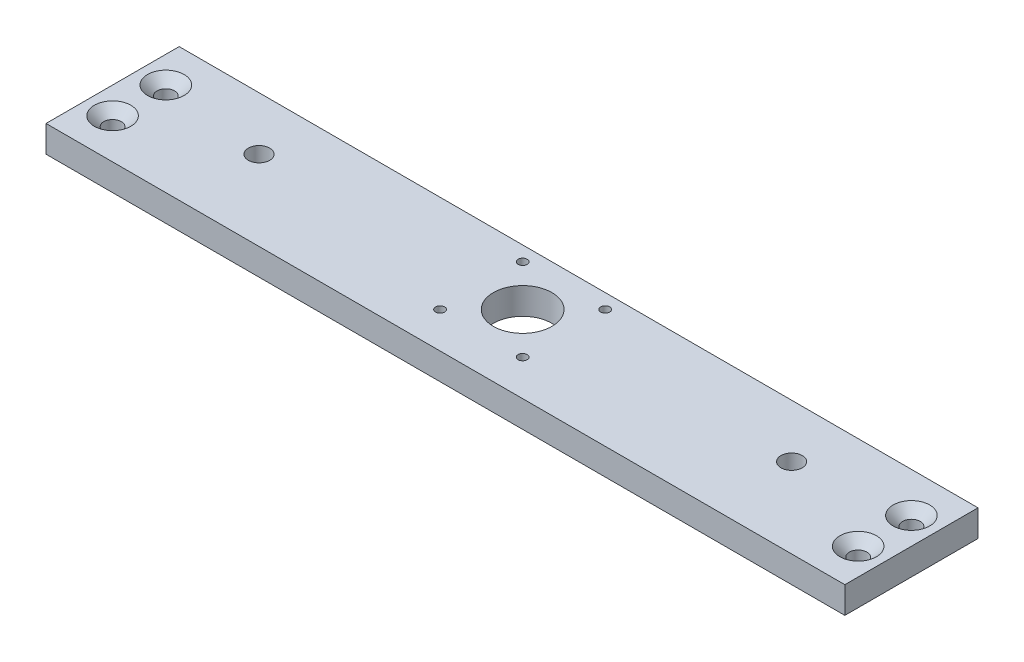
ISO-10303-21;
HEADER;
FILE_DESCRIPTION(('STEP AP214'),'2;1');
FILE_NAME('part.step','',(''),(''),'','','');
FILE_SCHEMA(('AUTOMOTIVE_DESIGN { 1 0 10303 214 1 1 1 1 }'));
ENDSEC;
DATA;
#1=APPLICATION_CONTEXT('core data for automotive mechanical design processes');
#2=APPLICATION_PROTOCOL_DEFINITION('international standard','automotive_design',2000,#1);
#3=PRODUCT_CONTEXT('',#1,'mechanical');
#4=PRODUCT('Part','Part','',(#3));
#5=PRODUCT_RELATED_PRODUCT_CATEGORY('part','',(#4));
#6=PRODUCT_DEFINITION_FORMATION('','',#4);
#7=PRODUCT_DEFINITION_CONTEXT('part definition',#1,'design');
#8=PRODUCT_DEFINITION('design','',#6,#7);
#9=PRODUCT_DEFINITION_SHAPE('','',#8);
#10=(LENGTH_UNIT() NAMED_UNIT(*) SI_UNIT(.MILLI.,.METRE.));
#11=(NAMED_UNIT(*) PLANE_ANGLE_UNIT() SI_UNIT($,.RADIAN.));
#12=(NAMED_UNIT(*) SI_UNIT($,.STERADIAN.) SOLID_ANGLE_UNIT());
#13=UNCERTAINTY_MEASURE_WITH_UNIT(LENGTH_MEASURE(1.E-05),#10,'distance_accuracy_value','');
#14=(GEOMETRIC_REPRESENTATION_CONTEXT(3) GLOBAL_UNCERTAINTY_ASSIGNED_CONTEXT((#13)) GLOBAL_UNIT_ASSIGNED_CONTEXT((#10,
#11,#12)) REPRESENTATION_CONTEXT('',''));
#15=CARTESIAN_POINT('',(0.,0.,0.));
#16=DIRECTION('',(0.,0.,1.));
#17=DIRECTION('',(1.,0.,0.));
#18=AXIS2_PLACEMENT_3D('',#15,#16,#17);
#19=CARTESIAN_POINT('',(0.,10.,0.));
#20=DIRECTION('',(0.,1.,0.));
#21=DIRECTION('',(0.,0.,1.));
#22=AXIS2_PLACEMENT_3D('',#19,#20,#21);
#23=PLANE('',#22);
#24=CARTESIAN_POINT('',(-15.5,10.,16.5));
#25=DIRECTION('',(0.,1.,0.));
#26=DIRECTION('',(0.,0.,1.));
#27=AXIS2_PLACEMENT_3D('',#24,#25,#26);
#28=CIRCLE('',#27,1.7);
#29=CARTESIAN_POINT('',(-15.5,10.,18.2));
#30=VERTEX_POINT('',#29);
#31=EDGE_CURVE('E40',#30,#30,#28,.T.);
#32=ORIENTED_EDGE('',*,*,#31,.F.);
#33=EDGE_LOOP('',(#32));
#34=FACE_BOUND('',#33,.T.);
#35=CARTESIAN_POINT('',(15.5,10.,16.5));
#36=DIRECTION('',(0.,1.,0.));
#37=DIRECTION('',(0.,0.,1.));
#38=AXIS2_PLACEMENT_3D('',#35,#36,#37);
#39=CIRCLE('',#38,1.7);
#40=CARTESIAN_POINT('',(15.5,10.,18.2));
#41=VERTEX_POINT('',#40);
#42=EDGE_CURVE('E141',#41,#41,#39,.T.);
#43=ORIENTED_EDGE('',*,*,#42,.F.);
#44=EDGE_LOOP('',(#43));
#45=FACE_BOUND('',#44,.T.);
#46=CARTESIAN_POINT('',(15.5,10.,-14.5));
#47=DIRECTION('',(0.,1.,0.));
#48=DIRECTION('',(0.,0.,1.));
#49=AXIS2_PLACEMENT_3D('',#46,#47,#48);
#50=CIRCLE('',#49,1.7);
#51=CARTESIAN_POINT('',(15.5,10.,-12.8));
#52=VERTEX_POINT('',#51);
#53=EDGE_CURVE('E137',#52,#52,#50,.T.);
#54=ORIENTED_EDGE('',*,*,#53,.F.);
#55=EDGE_LOOP('',(#54));
#56=FACE_BOUND('',#55,.T.);
#57=CARTESIAN_POINT('',(-15.5,10.,-14.5));
#58=DIRECTION('',(0.,1.,0.));
#59=DIRECTION('',(0.,0.,1.));
#60=AXIS2_PLACEMENT_3D('',#57,#58,#59);
#61=CIRCLE('',#60,1.7);
#62=CARTESIAN_POINT('',(-15.5,10.,-12.8));
#63=VERTEX_POINT('',#62);
#64=EDGE_CURVE('E132',#63,#63,#61,.T.);
#65=ORIENTED_EDGE('',*,*,#64,.F.);
#66=EDGE_LOOP('',(#65));
#67=FACE_BOUND('',#66,.T.);
#68=CARTESIAN_POINT('',(140.,10.,15.));
#69=DIRECTION('',(0.,1.,0.));
#70=DIRECTION('',(0.,0.,1.));
#71=AXIS2_PLACEMENT_3D('',#68,#69,#70);
#72=CIRCLE('',#71,6.855);
#73=CARTESIAN_POINT('',(140.,10.,21.855));
#74=VERTEX_POINT('',#73);
#75=EDGE_CURVE('E135',#74,#74,#72,.T.);
#76=ORIENTED_EDGE('',*,*,#75,.F.);
#77=EDGE_LOOP('',(#76));
#78=FACE_BOUND('',#77,.T.);
#79=CARTESIAN_POINT('',(140.,10.,-5.));
#80=DIRECTION('',(0.,1.,0.));
#81=DIRECTION('',(0.,0.,1.));
#82=AXIS2_PLACEMENT_3D('',#79,#80,#81);
#83=CIRCLE('',#82,6.855);
#84=CARTESIAN_POINT('',(140.,10.,1.855));
#85=VERTEX_POINT('',#84);
#86=EDGE_CURVE('E130',#85,#85,#83,.T.);
#87=ORIENTED_EDGE('',*,*,#86,.F.);
#88=EDGE_LOOP('',(#87));
#89=FACE_BOUND('',#88,.T.);
#90=CARTESIAN_POINT('',(-140.,10.,15.));
#91=DIRECTION('',(0.,1.,0.));
#92=DIRECTION('',(0.,0.,1.));
#93=AXIS2_PLACEMENT_3D('',#90,#91,#92);
#94=CIRCLE('',#93,6.855);
#95=CARTESIAN_POINT('',(-140.,10.,21.855));
#96=VERTEX_POINT('',#95);
#97=EDGE_CURVE('E125',#96,#96,#94,.T.);
#98=ORIENTED_EDGE('',*,*,#97,.F.);
#99=EDGE_LOOP('',(#98));
#100=FACE_BOUND('',#99,.T.);
#101=CARTESIAN_POINT('',(-140.,10.,-4.99999999999996));
#102=DIRECTION('',(0.,1.,0.));
#103=DIRECTION('',(0.,0.,1.));
#104=AXIS2_PLACEMENT_3D('',#101,#102,#103);
#105=CIRCLE('',#104,6.855);
#106=CARTESIAN_POINT('',(-140.,10.,1.85500000000004));
#107=VERTEX_POINT('',#106);
#108=EDGE_CURVE('E120',#107,#107,#105,.T.);
#109=ORIENTED_EDGE('',*,*,#108,.F.);
#110=EDGE_LOOP('',(#109));
#111=FACE_BOUND('',#110,.T.);
#112=CARTESIAN_POINT('',(0.,10.,1.));
#113=DIRECTION('',(0.,1.,0.));
#114=DIRECTION('',(0.,0.,1.));
#115=AXIS2_PLACEMENT_3D('',#112,#113,#114);
#116=CIRCLE('',#115,11.);
#117=CARTESIAN_POINT('',(0.,10.,12.));
#118=VERTEX_POINT('',#117);
#119=EDGE_CURVE('E115',#118,#118,#116,.T.);
#120=ORIENTED_EDGE('',*,*,#119,.F.);
#121=EDGE_LOOP('',(#120));
#122=FACE_BOUND('',#121,.T.);
#123=CARTESIAN_POINT('',(-100.,10.,0.));
#124=DIRECTION('',(0.,1.,0.));
#125=DIRECTION('',(0.,0.,1.));
#126=AXIS2_PLACEMENT_3D('',#123,#124,#125);
#127=CIRCLE('',#126,4.00000000000001);
#128=CARTESIAN_POINT('',(-100.,10.,4.00000000000002));
#129=VERTEX_POINT('',#128);
#130=EDGE_CURVE('E106',#129,#129,#127,.T.);
#131=ORIENTED_EDGE('',*,*,#130,.F.);
#132=EDGE_LOOP('',(#131));
#133=FACE_BOUND('',#132,.T.);
#134=DIRECTION('',(0.,0.,1.));
#135=VECTOR('',#134,1.);
#136=CARTESIAN_POINT('',(-150.,10.,30.));
#137=LINE('',#136,#135);
#138=CARTESIAN_POINT('',(-150.,10.,-20.));
#139=VERTEX_POINT('',#138);
#140=CARTESIAN_POINT('',(-150.,10.,30.));
#141=VERTEX_POINT('',#140);
#142=EDGE_CURVE('E90',#139,#141,#137,.T.);
#143=ORIENTED_EDGE('',*,*,#142,.T.);
#144=DIRECTION('',(1.,0.,0.));
#145=VECTOR('',#144,1.);
#146=CARTESIAN_POINT('',(150.,10.,30.));
#147=LINE('',#146,#145);
#148=CARTESIAN_POINT('',(150.,10.,30.));
#149=VERTEX_POINT('',#148);
#150=EDGE_CURVE('E85',#141,#149,#147,.T.);
#151=ORIENTED_EDGE('',*,*,#150,.T.);
#152=DIRECTION('',(0.,0.,-1.));
#153=VECTOR('',#152,1.);
#154=CARTESIAN_POINT('',(150.,10.,30.));
#155=LINE('',#154,#153);
#156=CARTESIAN_POINT('',(150.,10.,-20.));
#157=VERTEX_POINT('',#156);
#158=EDGE_CURVE('E88',#149,#157,#155,.T.);
#159=ORIENTED_EDGE('',*,*,#158,.T.);
#160=DIRECTION('',(-1.,0.,0.));
#161=VECTOR('',#160,1.);
#162=CARTESIAN_POINT('',(150.,10.,-20.));
#163=LINE('',#162,#161);
#164=EDGE_CURVE('E55',#157,#139,#163,.T.);
#165=ORIENTED_EDGE('',*,*,#164,.T.);
#166=EDGE_LOOP('',(#143,#151,#159,#165));
#167=FACE_BOUND('',#166,.T.);
#168=CARTESIAN_POINT('',(100.,10.,0.));
#169=DIRECTION('',(0.,1.,0.));
#170=DIRECTION('',(0.,0.,-1.));
#171=AXIS2_PLACEMENT_3D('',#168,#169,#170);
#172=CIRCLE('',#171,3.99999999999999);
#173=CARTESIAN_POINT('',(100.,10.,-4.));
#174=VERTEX_POINT('',#173);
#175=EDGE_CURVE('E186',#174,#174,#172,.T.);
#176=ORIENTED_EDGE('',*,*,#175,.F.);
#177=EDGE_LOOP('',(#176));
#178=FACE_BOUND('',#177,.T.);
#179=ADVANCED_FACE('F36',(#34,#45,#56,#67,#78,#89,#100,#111,#122,#133,#167,#178),#23,.T.);
#180=CARTESIAN_POINT('',(0.,0.,0.));
#181=DIRECTION('',(0.,1.,0.));
#182=DIRECTION('',(0.,0.,1.));
#183=AXIS2_PLACEMENT_3D('',#180,#181,#182);
#184=PLANE('',#183);
#185=CARTESIAN_POINT('',(-15.5,0.,16.5));
#186=DIRECTION('',(0.,-1.,0.));
#187=DIRECTION('',(0.,0.,-1.));
#188=AXIS2_PLACEMENT_3D('',#185,#186,#187);
#189=CIRCLE('',#188,3.47);
#190=CARTESIAN_POINT('',(-15.5,0.,13.03));
#191=VERTEX_POINT('',#190);
#192=EDGE_CURVE('E484',#191,#191,#189,.T.);
#193=ORIENTED_EDGE('',*,*,#192,.F.);
#194=EDGE_LOOP('',(#193));
#195=FACE_BOUND('',#194,.T.);
#196=CARTESIAN_POINT('',(15.5,0.,16.5));
#197=DIRECTION('',(0.,-1.,0.));
#198=DIRECTION('',(0.,0.,-1.));
#199=AXIS2_PLACEMENT_3D('',#196,#197,#198);
#200=CIRCLE('',#199,3.47);
#201=CARTESIAN_POINT('',(15.5,0.,13.03));
#202=VERTEX_POINT('',#201);
#203=EDGE_CURVE('E150',#202,#202,#200,.T.);
#204=ORIENTED_EDGE('',*,*,#203,.F.);
#205=EDGE_LOOP('',(#204));
#206=FACE_BOUND('',#205,.T.);
#207=CARTESIAN_POINT('',(15.5,0.,-14.5));
#208=DIRECTION('',(0.,-1.,0.));
#209=DIRECTION('',(0.,0.,-1.));
#210=AXIS2_PLACEMENT_3D('',#207,#208,#209);
#211=CIRCLE('',#210,3.47);
#212=CARTESIAN_POINT('',(15.5,0.,-17.97));
#213=VERTEX_POINT('',#212);
#214=EDGE_CURVE('E143',#213,#213,#211,.T.);
#215=ORIENTED_EDGE('',*,*,#214,.F.);
#216=EDGE_LOOP('',(#215));
#217=FACE_BOUND('',#216,.T.);
#218=CARTESIAN_POINT('',(-15.5,0.,-14.5));
#219=DIRECTION('',(0.,-1.,0.));
#220=DIRECTION('',(0.,0.,-1.));
#221=AXIS2_PLACEMENT_3D('',#218,#219,#220);
#222=CIRCLE('',#221,3.47);
#223=CARTESIAN_POINT('',(-15.5,0.,-17.97));
#224=VERTEX_POINT('',#223);
#225=EDGE_CURVE('E139',#224,#224,#222,.T.);
#226=ORIENTED_EDGE('',*,*,#225,.F.);
#227=EDGE_LOOP('',(#226));
#228=FACE_BOUND('',#227,.T.);
#229=CARTESIAN_POINT('',(140.,0.,15.));
#230=DIRECTION('',(0.,1.,0.));
#231=DIRECTION('',(0.,0.,1.));
#232=AXIS2_PLACEMENT_3D('',#229,#230,#231);
#233=CIRCLE('',#232,3.3);
#234=CARTESIAN_POINT('',(140.,0.,18.3));
#235=VERTEX_POINT('',#234);
#236=EDGE_CURVE('E127',#235,#235,#233,.T.);
#237=ORIENTED_EDGE('',*,*,#236,.T.);
#238=EDGE_LOOP('',(#237));
#239=FACE_BOUND('',#238,.T.);
#240=CARTESIAN_POINT('',(140.,0.,-5.));
#241=DIRECTION('',(0.,1.,0.));
#242=DIRECTION('',(0.,0.,1.));
#243=AXIS2_PLACEMENT_3D('',#240,#241,#242);
#244=CIRCLE('',#243,3.3);
#245=CARTESIAN_POINT('',(140.,0.,-1.7));
#246=VERTEX_POINT('',#245);
#247=EDGE_CURVE('E122',#246,#246,#244,.T.);
#248=ORIENTED_EDGE('',*,*,#247,.T.);
#249=EDGE_LOOP('',(#248));
#250=FACE_BOUND('',#249,.T.);
#251=CARTESIAN_POINT('',(-140.,0.,15.));
#252=DIRECTION('',(0.,1.,0.));
#253=DIRECTION('',(0.,0.,1.));
#254=AXIS2_PLACEMENT_3D('',#251,#252,#253);
#255=CIRCLE('',#254,3.3);
#256=CARTESIAN_POINT('',(-140.,0.,18.3));
#257=VERTEX_POINT('',#256);
#258=EDGE_CURVE('E117',#257,#257,#255,.T.);
#259=ORIENTED_EDGE('',*,*,#258,.T.);
#260=EDGE_LOOP('',(#259));
#261=FACE_BOUND('',#260,.T.);
#262=CARTESIAN_POINT('',(-140.,0.,-4.99999999999996));
#263=DIRECTION('',(0.,1.,0.));
#264=DIRECTION('',(0.,0.,1.));
#265=AXIS2_PLACEMENT_3D('',#262,#263,#264);
#266=CIRCLE('',#265,3.3);
#267=CARTESIAN_POINT('',(-140.,0.,-1.69999999999996));
#268=VERTEX_POINT('',#267);
#269=EDGE_CURVE('E112',#268,#268,#266,.T.);
#270=ORIENTED_EDGE('',*,*,#269,.T.);
#271=EDGE_LOOP('',(#270));
#272=FACE_BOUND('',#271,.T.);
#273=CARTESIAN_POINT('',(0.,0.,1.));
#274=DIRECTION('',(0.,1.,0.));
#275=DIRECTION('',(0.,0.,1.));
#276=AXIS2_PLACEMENT_3D('',#273,#274,#275);
#277=CIRCLE('',#276,11.);
#278=CARTESIAN_POINT('',(0.,0.,12.));
#279=VERTEX_POINT('',#278);
#280=EDGE_CURVE('E180',#279,#279,#277,.T.);
#281=ORIENTED_EDGE('',*,*,#280,.T.);
#282=EDGE_LOOP('',(#281));
#283=FACE_BOUND('',#282,.T.);
#284=DIRECTION('',(0.,0.,1.));
#285=VECTOR('',#284,1.);
#286=CARTESIAN_POINT('',(-150.,0.,30.));
#287=LINE('',#286,#285);
#288=CARTESIAN_POINT('',(-150.,0.,-20.));
#289=VERTEX_POINT('',#288);
#290=CARTESIAN_POINT('',(-150.,0.,30.));
#291=VERTEX_POINT('',#290);
#292=EDGE_CURVE('E103',#289,#291,#287,.T.);
#293=ORIENTED_EDGE('',*,*,#292,.F.);
#294=DIRECTION('',(-1.,0.,0.));
#295=VECTOR('',#294,1.);
#296=CARTESIAN_POINT('',(150.,0.,-20.));
#297=LINE('',#296,#295);
#298=CARTESIAN_POINT('',(150.,0.,-20.));
#299=VERTEX_POINT('',#298);
#300=EDGE_CURVE('E78',#299,#289,#297,.T.);
#301=ORIENTED_EDGE('',*,*,#300,.F.);
#302=DIRECTION('',(0.,0.,-1.));
#303=VECTOR('',#302,1.);
#304=CARTESIAN_POINT('',(150.,0.,30.));
#305=LINE('',#304,#303);
#306=CARTESIAN_POINT('',(150.,0.,30.));
#307=VERTEX_POINT('',#306);
#308=EDGE_CURVE('E72',#307,#299,#305,.T.);
#309=ORIENTED_EDGE('',*,*,#308,.F.);
#310=DIRECTION('',(1.,0.,0.));
#311=VECTOR('',#310,1.);
#312=CARTESIAN_POINT('',(150.,0.,30.));
#313=LINE('',#312,#311);
#314=EDGE_CURVE('E94',#291,#307,#313,.T.);
#315=ORIENTED_EDGE('',*,*,#314,.F.);
#316=EDGE_LOOP('',(#293,#301,#309,#315));
#317=FACE_BOUND('',#316,.T.);
#318=CARTESIAN_POINT('',(-100.,0.,0.));
#319=DIRECTION('',(0.,1.,0.));
#320=DIRECTION('',(0.,0.,1.));
#321=AXIS2_PLACEMENT_3D('',#318,#319,#320);
#322=CIRCLE('',#321,4.00000000000001);
#323=CARTESIAN_POINT('',(-100.,0.,4.00000000000002));
#324=VERTEX_POINT('',#323);
#325=EDGE_CURVE('E189',#324,#324,#322,.T.);
#326=ORIENTED_EDGE('',*,*,#325,.T.);
#327=EDGE_LOOP('',(#326));
#328=FACE_BOUND('',#327,.T.);
#329=CARTESIAN_POINT('',(100.,0.,0.));
#330=DIRECTION('',(0.,1.,0.));
#331=DIRECTION('',(0.,0.,-1.));
#332=AXIS2_PLACEMENT_3D('',#329,#330,#331);
#333=CIRCLE('',#332,3.99999999999999);
#334=CARTESIAN_POINT('',(100.,0.,-4.));
#335=VERTEX_POINT('',#334);
#336=EDGE_CURVE('E183',#335,#335,#333,.T.);
#337=ORIENTED_EDGE('',*,*,#336,.T.);
#338=EDGE_LOOP('',(#337));
#339=FACE_BOUND('',#338,.T.);
#340=ADVANCED_FACE('F197',(#195,#206,#217,#228,#239,#250,#261,#272,#283,#317,#328,#339),#184,.F.);
#341=CARTESIAN_POINT('',(-150.,10.,30.));
#342=DIRECTION('',(1.,0.,0.));
#343=DIRECTION('',(0.,0.,-1.));
#344=AXIS2_PLACEMENT_3D('',#341,#342,#343);
#345=PLANE('',#344);
#346=ORIENTED_EDGE('',*,*,#292,.T.);
#347=DIRECTION('',(0.,-1.,0.));
#348=VECTOR('',#347,1.);
#349=CARTESIAN_POINT('',(-150.,10.,30.));
#350=LINE('',#349,#348);
#351=EDGE_CURVE('E11',#141,#291,#350,.T.);
#352=ORIENTED_EDGE('',*,*,#351,.F.);
#353=ORIENTED_EDGE('',*,*,#142,.F.);
#354=DIRECTION('',(0.,-1.,0.));
#355=VECTOR('',#354,1.);
#356=CARTESIAN_POINT('',(-150.,10.,-20.));
#357=LINE('',#356,#355);
#358=EDGE_CURVE('E99',#139,#289,#357,.T.);
#359=ORIENTED_EDGE('',*,*,#358,.T.);
#360=EDGE_LOOP('',(#346,#352,#353,#359));
#361=FACE_BOUND('',#360,.T.);
#362=ADVANCED_FACE('F38',(#361),#345,.F.);
#363=CARTESIAN_POINT('',(150.,10.,30.));
#364=DIRECTION('',(0.,0.,-1.));
#365=DIRECTION('',(-1.,0.,0.));
#366=AXIS2_PLACEMENT_3D('',#363,#364,#365);
#367=PLANE('',#366);
#368=ORIENTED_EDGE('',*,*,#314,.T.);
#369=DIRECTION('',(0.,-1.,0.));
#370=VECTOR('',#369,1.);
#371=CARTESIAN_POINT('',(150.,10.,30.));
#372=LINE('',#371,#370);
#373=EDGE_CURVE('E46',#149,#307,#372,.T.);
#374=ORIENTED_EDGE('',*,*,#373,.F.);
#375=ORIENTED_EDGE('',*,*,#150,.F.);
#376=ORIENTED_EDGE('',*,*,#351,.T.);
#377=EDGE_LOOP('',(#368,#374,#375,#376));
#378=FACE_BOUND('',#377,.T.);
#379=ADVANCED_FACE('F93',(#378),#367,.F.);
#380=CARTESIAN_POINT('',(150.,10.,30.));
#381=DIRECTION('',(-1.,0.,0.));
#382=DIRECTION('',(0.,0.,1.));
#383=AXIS2_PLACEMENT_3D('',#380,#381,#382);
#384=PLANE('',#383);
#385=ORIENTED_EDGE('',*,*,#308,.T.);
#386=DIRECTION('',(0.,-1.,0.));
#387=VECTOR('',#386,1.);
#388=CARTESIAN_POINT('',(150.,10.,-20.));
#389=LINE('',#388,#387);
#390=EDGE_CURVE('E95',#157,#299,#389,.T.);
#391=ORIENTED_EDGE('',*,*,#390,.F.);
#392=ORIENTED_EDGE('',*,*,#158,.F.);
#393=ORIENTED_EDGE('',*,*,#373,.T.);
#394=EDGE_LOOP('',(#385,#391,#392,#393));
#395=FACE_BOUND('',#394,.T.);
#396=ADVANCED_FACE('F97',(#395),#384,.F.);
#397=CARTESIAN_POINT('',(150.,10.,-20.));
#398=DIRECTION('',(0.,0.,1.));
#399=DIRECTION('',(1.,0.,0.));
#400=AXIS2_PLACEMENT_3D('',#397,#398,#399);
#401=PLANE('',#400);
#402=ORIENTED_EDGE('',*,*,#300,.T.);
#403=ORIENTED_EDGE('',*,*,#358,.F.);
#404=ORIENTED_EDGE('',*,*,#164,.F.);
#405=ORIENTED_EDGE('',*,*,#390,.T.);
#406=EDGE_LOOP('',(#402,#403,#404,#405));
#407=FACE_BOUND('',#406,.T.);
#408=ADVANCED_FACE('F203',(#407),#401,.F.);
#409=CARTESIAN_POINT('',(-100.,10.,0.));
#410=DIRECTION('',(0.,-1.,0.));
#411=DIRECTION('',(0.,0.,-1.));
#412=AXIS2_PLACEMENT_3D('',#409,#410,#411);
#413=CYLINDRICAL_SURFACE('',#412,4.00000000000001);
#414=ORIENTED_EDGE('',*,*,#130,.T.);
#415=EDGE_LOOP('',(#414));
#416=FACE_BOUND('',#415,.T.);
#417=ORIENTED_EDGE('',*,*,#325,.F.);
#418=EDGE_LOOP('',(#417));
#419=FACE_BOUND('',#418,.T.);
#420=ADVANCED_FACE('F200',(#416,#419),#413,.F.);
#421=CARTESIAN_POINT('',(100.,10.,0.));
#422=DIRECTION('',(0.,-1.,0.));
#423=DIRECTION('',(0.,0.,-1.));
#424=AXIS2_PLACEMENT_3D('',#421,#422,#423);
#425=CYLINDRICAL_SURFACE('',#424,3.99999999999999);
#426=ORIENTED_EDGE('',*,*,#175,.T.);
#427=EDGE_LOOP('',(#426));
#428=FACE_BOUND('',#427,.T.);
#429=ORIENTED_EDGE('',*,*,#336,.F.);
#430=EDGE_LOOP('',(#429));
#431=FACE_BOUND('',#430,.T.);
#432=ADVANCED_FACE('F202',(#428,#431),#425,.F.);
#433=CARTESIAN_POINT('',(0.,0.,1.));
#434=DIRECTION('',(0.,1.,0.));
#435=DIRECTION('',(0.,0.,1.));
#436=AXIS2_PLACEMENT_3D('',#433,#434,#435);
#437=CYLINDRICAL_SURFACE('',#436,11.);
#438=ORIENTED_EDGE('',*,*,#280,.F.);
#439=EDGE_LOOP('',(#438));
#440=FACE_BOUND('',#439,.T.);
#441=ORIENTED_EDGE('',*,*,#119,.T.);
#442=EDGE_LOOP('',(#441));
#443=FACE_BOUND('',#442,.T.);
#444=ADVANCED_FACE('F210',(#440,#443),#437,.F.);
#445=CARTESIAN_POINT('',(-140.,10.,-4.99999999999996));
#446=DIRECTION('',(0.,1.,0.));
#447=DIRECTION('',(0.,0.,1.));
#448=AXIS2_PLACEMENT_3D('',#445,#446,#447);
#449=CYLINDRICAL_SURFACE('',#448,3.3);
#450=CARTESIAN_POINT('',(-140.,6.445,-4.99999999999996));
#451=DIRECTION('',(0.,1.,0.));
#452=DIRECTION('',(0.,0.,1.));
#453=AXIS2_PLACEMENT_3D('',#450,#451,#452);
#454=CIRCLE('',#453,3.3);
#455=CARTESIAN_POINT('',(-140.,6.445,-1.69999999999996));
#456=VERTEX_POINT('',#455);
#457=EDGE_CURVE('E116',#456,#456,#454,.T.);
#458=ORIENTED_EDGE('',*,*,#457,.T.);
#459=EDGE_LOOP('',(#458));
#460=FACE_BOUND('',#459,.T.);
#461=ORIENTED_EDGE('',*,*,#269,.F.);
#462=EDGE_LOOP('',(#461));
#463=FACE_BOUND('',#462,.T.);
#464=ADVANCED_FACE('F358',(#460,#463),#449,.F.);
#465=CARTESIAN_POINT('',(-140.,10.,-4.99999999999996));
#466=DIRECTION('',(0.,1.,0.));
#467=DIRECTION('',(0.,0.,1.));
#468=AXIS2_PLACEMENT_3D('',#465,#466,#467);
#469=CONICAL_SURFACE('',#468,6.855,0.785398163397448);
#470=ORIENTED_EDGE('',*,*,#457,.F.);
#471=EDGE_LOOP('',(#470));
#472=FACE_BOUND('',#471,.T.);
#473=ORIENTED_EDGE('',*,*,#108,.T.);
#474=EDGE_LOOP('',(#473));
#475=FACE_BOUND('',#474,.T.);
#476=ADVANCED_FACE('F354',(#472,#475),#469,.F.);
#477=CARTESIAN_POINT('',(-140.,10.,15.));
#478=DIRECTION('',(0.,1.,0.));
#479=DIRECTION('',(0.,0.,1.));
#480=AXIS2_PLACEMENT_3D('',#477,#478,#479);
#481=CYLINDRICAL_SURFACE('',#480,3.3);
#482=CARTESIAN_POINT('',(-140.,6.445,15.));
#483=DIRECTION('',(0.,1.,0.));
#484=DIRECTION('',(0.,0.,1.));
#485=AXIS2_PLACEMENT_3D('',#482,#483,#484);
#486=CIRCLE('',#485,3.3);
#487=CARTESIAN_POINT('',(-140.,6.445,18.3));
#488=VERTEX_POINT('',#487);
#489=EDGE_CURVE('E121',#488,#488,#486,.T.);
#490=ORIENTED_EDGE('',*,*,#489,.T.);
#491=EDGE_LOOP('',(#490));
#492=FACE_BOUND('',#491,.T.);
#493=ORIENTED_EDGE('',*,*,#258,.F.);
#494=EDGE_LOOP('',(#493));
#495=FACE_BOUND('',#494,.T.);
#496=ADVANCED_FACE('F350',(#492,#495),#481,.F.);
#497=CARTESIAN_POINT('',(-140.,10.,15.));
#498=DIRECTION('',(0.,1.,0.));
#499=DIRECTION('',(0.,0.,1.));
#500=AXIS2_PLACEMENT_3D('',#497,#498,#499);
#501=CONICAL_SURFACE('',#500,6.855,0.785398163397448);
#502=ORIENTED_EDGE('',*,*,#489,.F.);
#503=EDGE_LOOP('',(#502));
#504=FACE_BOUND('',#503,.T.);
#505=ORIENTED_EDGE('',*,*,#97,.T.);
#506=EDGE_LOOP('',(#505));
#507=FACE_BOUND('',#506,.T.);
#508=ADVANCED_FACE('F346',(#504,#507),#501,.F.);
#509=CARTESIAN_POINT('',(140.,10.,-5.));
#510=DIRECTION('',(0.,1.,0.));
#511=DIRECTION('',(0.,0.,1.));
#512=AXIS2_PLACEMENT_3D('',#509,#510,#511);
#513=CYLINDRICAL_SURFACE('',#512,3.3);
#514=CARTESIAN_POINT('',(140.,6.445,-5.));
#515=DIRECTION('',(0.,1.,0.));
#516=DIRECTION('',(0.,0.,1.));
#517=AXIS2_PLACEMENT_3D('',#514,#515,#516);
#518=CIRCLE('',#517,3.3);
#519=CARTESIAN_POINT('',(140.,6.445,-1.7));
#520=VERTEX_POINT('',#519);
#521=EDGE_CURVE('E126',#520,#520,#518,.T.);
#522=ORIENTED_EDGE('',*,*,#521,.T.);
#523=EDGE_LOOP('',(#522));
#524=FACE_BOUND('',#523,.T.);
#525=ORIENTED_EDGE('',*,*,#247,.F.);
#526=EDGE_LOOP('',(#525));
#527=FACE_BOUND('',#526,.T.);
#528=ADVANCED_FACE('F342',(#524,#527),#513,.F.);
#529=CARTESIAN_POINT('',(140.,10.,-5.));
#530=DIRECTION('',(0.,1.,0.));
#531=DIRECTION('',(0.,0.,1.));
#532=AXIS2_PLACEMENT_3D('',#529,#530,#531);
#533=CONICAL_SURFACE('',#532,6.855,0.785398163397448);
#534=ORIENTED_EDGE('',*,*,#521,.F.);
#535=EDGE_LOOP('',(#534));
#536=FACE_BOUND('',#535,.T.);
#537=ORIENTED_EDGE('',*,*,#86,.T.);
#538=EDGE_LOOP('',(#537));
#539=FACE_BOUND('',#538,.T.);
#540=ADVANCED_FACE('F338',(#536,#539),#533,.F.);
#541=CARTESIAN_POINT('',(140.,10.,15.));
#542=DIRECTION('',(0.,1.,0.));
#543=DIRECTION('',(0.,0.,1.));
#544=AXIS2_PLACEMENT_3D('',#541,#542,#543);
#545=CYLINDRICAL_SURFACE('',#544,3.3);
#546=CARTESIAN_POINT('',(140.,6.445,15.));
#547=DIRECTION('',(0.,1.,0.));
#548=DIRECTION('',(0.,0.,1.));
#549=AXIS2_PLACEMENT_3D('',#546,#547,#548);
#550=CIRCLE('',#549,3.3);
#551=CARTESIAN_POINT('',(140.,6.445,18.3));
#552=VERTEX_POINT('',#551);
#553=EDGE_CURVE('E131',#552,#552,#550,.T.);
#554=ORIENTED_EDGE('',*,*,#553,.T.);
#555=EDGE_LOOP('',(#554));
#556=FACE_BOUND('',#555,.T.);
#557=ORIENTED_EDGE('',*,*,#236,.F.);
#558=EDGE_LOOP('',(#557));
#559=FACE_BOUND('',#558,.T.);
#560=ADVANCED_FACE('F334',(#556,#559),#545,.F.);
#561=CARTESIAN_POINT('',(140.,10.,15.));
#562=DIRECTION('',(0.,1.,0.));
#563=DIRECTION('',(0.,0.,1.));
#564=AXIS2_PLACEMENT_3D('',#561,#562,#563);
#565=CONICAL_SURFACE('',#564,6.855,0.785398163397448);
#566=ORIENTED_EDGE('',*,*,#553,.F.);
#567=EDGE_LOOP('',(#566));
#568=FACE_BOUND('',#567,.T.);
#569=ORIENTED_EDGE('',*,*,#75,.T.);
#570=EDGE_LOOP('',(#569));
#571=FACE_BOUND('',#570,.T.);
#572=ADVANCED_FACE('F255',(#568,#571),#565,.F.);
#573=CARTESIAN_POINT('',(-15.5,0.,-14.5));
#574=DIRECTION('',(0.,-1.,0.));
#575=DIRECTION('',(0.,0.,-1.));
#576=AXIS2_PLACEMENT_3D('',#573,#574,#575);
#577=CYLINDRICAL_SURFACE('',#576,1.7);
#578=ORIENTED_EDGE('',*,*,#64,.T.);
#579=EDGE_LOOP('',(#578));
#580=FACE_BOUND('',#579,.T.);
#581=CARTESIAN_POINT('',(-15.5,1.77,-14.5));
#582=DIRECTION('',(0.,-1.,0.));
#583=DIRECTION('',(0.,0.,-1.));
#584=AXIS2_PLACEMENT_3D('',#581,#582,#583);
#585=CIRCLE('',#584,1.7);
#586=CARTESIAN_POINT('',(-15.5,1.77,-16.2));
#587=VERTEX_POINT('',#586);
#588=EDGE_CURVE('E136',#587,#587,#585,.T.);
#589=ORIENTED_EDGE('',*,*,#588,.T.);
#590=EDGE_LOOP('',(#589));
#591=FACE_BOUND('',#590,.T.);
#592=ADVANCED_FACE('F249',(#580,#591),#577,.F.);
#593=CARTESIAN_POINT('',(-15.5,0.,-14.5));
#594=DIRECTION('',(0.,-1.,0.));
#595=DIRECTION('',(0.,0.,-1.));
#596=AXIS2_PLACEMENT_3D('',#593,#594,#595);
#597=CONICAL_SURFACE('',#596,3.47,0.785398163397449);
#598=ORIENTED_EDGE('',*,*,#588,.F.);
#599=EDGE_LOOP('',(#598));
#600=FACE_BOUND('',#599,.T.);
#601=ORIENTED_EDGE('',*,*,#225,.T.);
#602=EDGE_LOOP('',(#601));
#603=FACE_BOUND('',#602,.T.);
#604=ADVANCED_FACE('F254',(#600,#603),#597,.F.);
#605=CARTESIAN_POINT('',(15.5,0.,-14.5));
#606=DIRECTION('',(0.,-1.,0.));
#607=DIRECTION('',(0.,0.,-1.));
#608=AXIS2_PLACEMENT_3D('',#605,#606,#607);
#609=CYLINDRICAL_SURFACE('',#608,1.7);
#610=ORIENTED_EDGE('',*,*,#53,.T.);
#611=EDGE_LOOP('',(#610));
#612=FACE_BOUND('',#611,.T.);
#613=CARTESIAN_POINT('',(15.5,1.77,-14.5));
#614=DIRECTION('',(0.,-1.,0.));
#615=DIRECTION('',(0.,0.,-1.));
#616=AXIS2_PLACEMENT_3D('',#613,#614,#615);
#617=CIRCLE('',#616,1.7);
#618=CARTESIAN_POINT('',(15.5,1.77,-16.2));
#619=VERTEX_POINT('',#618);
#620=EDGE_CURVE('E140',#619,#619,#617,.T.);
#621=ORIENTED_EDGE('',*,*,#620,.T.);
#622=EDGE_LOOP('',(#621));
#623=FACE_BOUND('',#622,.T.);
#624=ADVANCED_FACE('F267',(#612,#623),#609,.F.);
#625=CARTESIAN_POINT('',(15.5,0.,-14.5));
#626=DIRECTION('',(0.,-1.,0.));
#627=DIRECTION('',(0.,0.,-1.));
#628=AXIS2_PLACEMENT_3D('',#625,#626,#627);
#629=CONICAL_SURFACE('',#628,3.47,0.785398163397448);
#630=ORIENTED_EDGE('',*,*,#620,.F.);
#631=EDGE_LOOP('',(#630));
#632=FACE_BOUND('',#631,.T.);
#633=ORIENTED_EDGE('',*,*,#214,.T.);
#634=EDGE_LOOP('',(#633));
#635=FACE_BOUND('',#634,.T.);
#636=ADVANCED_FACE('F277',(#632,#635),#629,.F.);
#637=CARTESIAN_POINT('',(15.5,0.,16.5));
#638=DIRECTION('',(0.,-1.,0.));
#639=DIRECTION('',(0.,0.,-1.));
#640=AXIS2_PLACEMENT_3D('',#637,#638,#639);
#641=CYLINDRICAL_SURFACE('',#640,1.7);
#642=ORIENTED_EDGE('',*,*,#42,.T.);
#643=EDGE_LOOP('',(#642));
#644=FACE_BOUND('',#643,.T.);
#645=CARTESIAN_POINT('',(15.5,1.77,16.5));
#646=DIRECTION('',(0.,-1.,0.));
#647=DIRECTION('',(0.,0.,-1.));
#648=AXIS2_PLACEMENT_3D('',#645,#646,#647);
#649=CIRCLE('',#648,1.7);
#650=CARTESIAN_POINT('',(15.5,1.77,14.8));
#651=VERTEX_POINT('',#650);
#652=EDGE_CURVE('E144',#651,#651,#649,.T.);
#653=ORIENTED_EDGE('',*,*,#652,.T.);
#654=EDGE_LOOP('',(#653));
#655=FACE_BOUND('',#654,.T.);
#656=ADVANCED_FACE('F287',(#644,#655),#641,.F.);
#657=CARTESIAN_POINT('',(15.5,0.,16.5));
#658=DIRECTION('',(0.,-1.,0.));
#659=DIRECTION('',(0.,0.,-1.));
#660=AXIS2_PLACEMENT_3D('',#657,#658,#659);
#661=CONICAL_SURFACE('',#660,3.47,0.785398163397448);
#662=ORIENTED_EDGE('',*,*,#652,.F.);
#663=EDGE_LOOP('',(#662));
#664=FACE_BOUND('',#663,.T.);
#665=ORIENTED_EDGE('',*,*,#203,.T.);
#666=EDGE_LOOP('',(#665));
#667=FACE_BOUND('',#666,.T.);
#668=ADVANCED_FACE('F297',(#664,#667),#661,.F.);
#669=CARTESIAN_POINT('',(-15.5,0.,16.5));
#670=DIRECTION('',(0.,-1.,0.));
#671=DIRECTION('',(0.,0.,-1.));
#672=AXIS2_PLACEMENT_3D('',#669,#670,#671);
#673=CYLINDRICAL_SURFACE('',#672,1.7);
#674=ORIENTED_EDGE('',*,*,#31,.T.);
#675=EDGE_LOOP('',(#674));
#676=FACE_BOUND('',#675,.T.);
#677=CARTESIAN_POINT('',(-15.5,1.77,16.5));
#678=DIRECTION('',(0.,-1.,0.));
#679=DIRECTION('',(0.,0.,-1.));
#680=AXIS2_PLACEMENT_3D('',#677,#678,#679);
#681=CIRCLE('',#680,1.7);
#682=CARTESIAN_POINT('',(-15.5,1.77,14.8));
#683=VERTEX_POINT('',#682);
#684=EDGE_CURVE('E481',#683,#683,#681,.T.);
#685=ORIENTED_EDGE('',*,*,#684,.T.);
#686=EDGE_LOOP('',(#685));
#687=FACE_BOUND('',#686,.T.);
#688=ADVANCED_FACE('F306',(#676,#687),#673,.F.);
#689=CARTESIAN_POINT('',(-15.5,0.,16.5));
#690=DIRECTION('',(0.,-1.,0.));
#691=DIRECTION('',(0.,0.,-1.));
#692=AXIS2_PLACEMENT_3D('',#689,#690,#691);
#693=CONICAL_SURFACE('',#692,3.47,0.785398163397449);
#694=ORIENTED_EDGE('',*,*,#684,.F.);
#695=EDGE_LOOP('',(#694));
#696=FACE_BOUND('',#695,.T.);
#697=ORIENTED_EDGE('',*,*,#192,.T.);
#698=EDGE_LOOP('',(#697));
#699=FACE_BOUND('',#698,.T.);
#700=ADVANCED_FACE('F316',(#696,#699),#693,.F.);
#701=CLOSED_SHELL('',(#179,#340,#362,#379,#396,#408,#420,#432,#444,#464,#476,#496,#508,#528,
#540,#560,#572,#592,#604,#624,#636,#656,#668,#688,#700));
#702=MANIFOLD_SOLID_BREP('B2',#701);
#703=ADVANCED_BREP_SHAPE_REPRESENTATION('',(#18,#702),#14);
#704=SHAPE_DEFINITION_REPRESENTATION(#9,#703);
ENDSEC;
END-ISO-10303-21;
